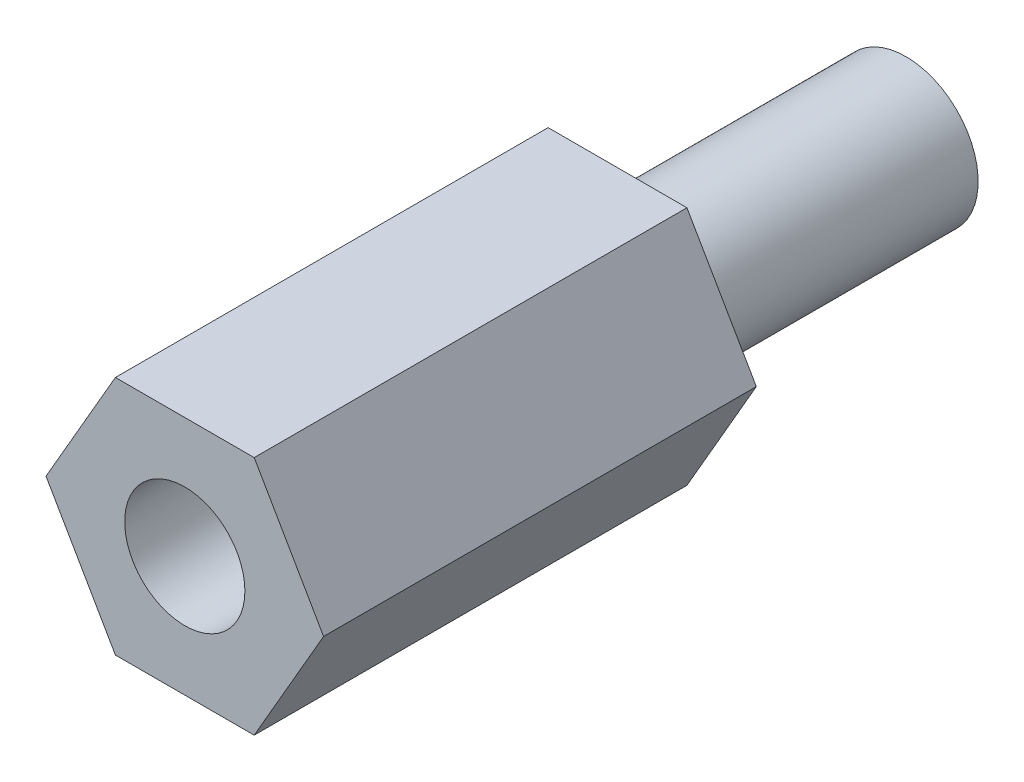
ISO-10303-21;
HEADER;
FILE_DESCRIPTION(('STEP AP214'),'2;1');
FILE_NAME('part.step','',(''),(''),'','','');
FILE_SCHEMA(('AUTOMOTIVE_DESIGN { 1 0 10303 214 1 1 1 1 }'));
ENDSEC;
DATA;
#1=APPLICATION_CONTEXT('core data for automotive mechanical design processes');
#2=APPLICATION_PROTOCOL_DEFINITION('international standard','automotive_design',2000,#1);
#3=PRODUCT_CONTEXT('',#1,'mechanical');
#4=PRODUCT('Part','Part','',(#3));
#5=PRODUCT_RELATED_PRODUCT_CATEGORY('part','',(#4));
#6=PRODUCT_DEFINITION_FORMATION('','',#4);
#7=PRODUCT_DEFINITION_CONTEXT('part definition',#1,'design');
#8=PRODUCT_DEFINITION('design','',#6,#7);
#9=PRODUCT_DEFINITION_SHAPE('','',#8);
#10=(LENGTH_UNIT() NAMED_UNIT(*) SI_UNIT(.MILLI.,.METRE.));
#11=(NAMED_UNIT(*) PLANE_ANGLE_UNIT() SI_UNIT($,.RADIAN.));
#12=(NAMED_UNIT(*) SI_UNIT($,.STERADIAN.) SOLID_ANGLE_UNIT());
#13=UNCERTAINTY_MEASURE_WITH_UNIT(LENGTH_MEASURE(1.E-05),#10,'distance_accuracy_value','');
#14=(GEOMETRIC_REPRESENTATION_CONTEXT(3) GLOBAL_UNCERTAINTY_ASSIGNED_CONTEXT((#13)) GLOBAL_UNIT_ASSIGNED_CONTEXT((#10,
#11,#12)) REPRESENTATION_CONTEXT('',''));
#15=CARTESIAN_POINT('',(0.,0.,0.));
#16=DIRECTION('',(0.,0.,1.));
#17=DIRECTION('',(1.,0.,0.));
#18=AXIS2_PLACEMENT_3D('',#15,#16,#17);
#19=CARTESIAN_POINT('',(1.44337567297406,2.5,9.));
#20=DIRECTION('',(0.,-1.,0.));
#21=DIRECTION('',(1.,0.,0.));
#22=AXIS2_PLACEMENT_3D('',#19,#20,#21);
#23=PLANE('',#22);
#24=DIRECTION('',(-1.,0.,0.));
#25=VECTOR('',#24,1.);
#26=CARTESIAN_POINT('',(1.44337567297406,2.5,0.));
#27=LINE('',#26,#25);
#28=CARTESIAN_POINT('',(1.44337567297406,2.5,0.));
#29=VERTEX_POINT('',#28);
#30=CARTESIAN_POINT('',(-1.44337567297407,2.5,0.));
#31=VERTEX_POINT('',#30);
#32=EDGE_CURVE('E125',#29,#31,#27,.T.);
#33=ORIENTED_EDGE('',*,*,#32,.T.);
#34=DIRECTION('',(0.,0.,-1.));
#35=VECTOR('',#34,1.);
#36=CARTESIAN_POINT('',(-1.44337567297407,2.5,9.));
#37=LINE('',#36,#35);
#38=CARTESIAN_POINT('',(-1.44337567297407,2.5,9.));
#39=VERTEX_POINT('',#38);
#40=EDGE_CURVE('E40',#39,#31,#37,.T.);
#41=ORIENTED_EDGE('',*,*,#40,.F.);
#42=DIRECTION('',(-1.,0.,0.));
#43=VECTOR('',#42,1.);
#44=CARTESIAN_POINT('',(1.44337567297406,2.5,9.));
#45=LINE('',#44,#43);
#46=CARTESIAN_POINT('',(1.44337567297406,2.5,9.));
#47=VERTEX_POINT('',#46);
#48=EDGE_CURVE('E136',#47,#39,#45,.T.);
#49=ORIENTED_EDGE('',*,*,#48,.F.);
#50=DIRECTION('',(0.,0.,-1.));
#51=VECTOR('',#50,1.);
#52=CARTESIAN_POINT('',(1.44337567297406,2.5,9.));
#53=LINE('',#52,#51);
#54=EDGE_CURVE('E121',#47,#29,#53,.T.);
#55=ORIENTED_EDGE('',*,*,#54,.T.);
#56=EDGE_LOOP('',(#33,#41,#49,#55));
#57=FACE_BOUND('',#56,.T.);
#58=ADVANCED_FACE('F37',(#57),#23,.F.);
#59=CARTESIAN_POINT('',(-1.44337567297407,2.5,9.));
#60=DIRECTION('',(0.866025403784439,-0.5,0.));
#61=DIRECTION('',(0.5,0.866025403784439,0.));
#62=AXIS2_PLACEMENT_3D('',#59,#60,#61);
#63=PLANE('',#62);
#64=DIRECTION('',(-0.5,-0.866025403784439,0.));
#65=VECTOR('',#64,1.);
#66=CARTESIAN_POINT('',(-1.44337567297407,2.5,0.));
#67=LINE('',#66,#65);
#68=CARTESIAN_POINT('',(-2.88675134594813,0.,0.));
#69=VERTEX_POINT('',#68);
#70=EDGE_CURVE('E128',#31,#69,#67,.T.);
#71=ORIENTED_EDGE('',*,*,#70,.T.);
#72=DIRECTION('',(0.,0.,-1.));
#73=VECTOR('',#72,1.);
#74=CARTESIAN_POINT('',(-2.88675134594813,0.,9.));
#75=LINE('',#74,#73);
#76=CARTESIAN_POINT('',(-2.88675134594813,0.,9.));
#77=VERTEX_POINT('',#76);
#78=EDGE_CURVE('E139',#77,#69,#75,.T.);
#79=ORIENTED_EDGE('',*,*,#78,.F.);
#80=DIRECTION('',(-0.5,-0.866025403784439,0.));
#81=VECTOR('',#80,1.);
#82=CARTESIAN_POINT('',(-1.44337567297407,2.5,9.));
#83=LINE('',#82,#81);
#84=EDGE_CURVE('E93',#39,#77,#83,.T.);
#85=ORIENTED_EDGE('',*,*,#84,.F.);
#86=ORIENTED_EDGE('',*,*,#40,.T.);
#87=EDGE_LOOP('',(#71,#79,#85,#86));
#88=FACE_BOUND('',#87,.T.);
#89=ADVANCED_FACE('F144',(#88),#63,.F.);
#90=CARTESIAN_POINT('',(-2.88675134594813,0.,9.));
#91=DIRECTION('',(0.866025403784438,0.5,0.));
#92=DIRECTION('',(-0.500000000000001,0.866025403784438,0.));
#93=AXIS2_PLACEMENT_3D('',#90,#91,#92);
#94=PLANE('',#93);
#95=DIRECTION('',(0.5,-0.866025403784438,0.));
#96=VECTOR('',#95,1.);
#97=CARTESIAN_POINT('',(-2.88675134594813,0.,0.));
#98=LINE('',#97,#96);
#99=CARTESIAN_POINT('',(-1.44337567297406,-2.5,0.));
#100=VERTEX_POINT('',#99);
#101=EDGE_CURVE('E131',#69,#100,#98,.T.);
#102=ORIENTED_EDGE('',*,*,#101,.T.);
#103=DIRECTION('',(0.,0.,-1.));
#104=VECTOR('',#103,1.);
#105=CARTESIAN_POINT('',(-1.44337567297406,-2.5,9.));
#106=LINE('',#105,#104);
#107=CARTESIAN_POINT('',(-1.44337567297406,-2.5,9.));
#108=VERTEX_POINT('',#107);
#109=EDGE_CURVE('E116',#108,#100,#106,.T.);
#110=ORIENTED_EDGE('',*,*,#109,.F.);
#111=DIRECTION('',(0.5,-0.866025403784438,0.));
#112=VECTOR('',#111,1.);
#113=CARTESIAN_POINT('',(-2.88675134594813,0.,9.));
#114=LINE('',#113,#112);
#115=EDGE_CURVE('E107',#77,#108,#114,.T.);
#116=ORIENTED_EDGE('',*,*,#115,.F.);
#117=ORIENTED_EDGE('',*,*,#78,.T.);
#118=EDGE_LOOP('',(#102,#110,#116,#117));
#119=FACE_BOUND('',#118,.T.);
#120=ADVANCED_FACE('F150',(#119),#94,.F.);
#121=CARTESIAN_POINT('',(-1.44337567297406,-2.5,9.));
#122=DIRECTION('',(0.,1.,0.));
#123=DIRECTION('',(-1.,0.,0.));
#124=AXIS2_PLACEMENT_3D('',#121,#122,#123);
#125=PLANE('',#124);
#126=DIRECTION('',(1.,0.,0.));
#127=VECTOR('',#126,1.);
#128=CARTESIAN_POINT('',(-1.44337567297406,-2.5,0.));
#129=LINE('',#128,#127);
#130=CARTESIAN_POINT('',(1.44337567297407,-2.5,0.));
#131=VERTEX_POINT('',#130);
#132=EDGE_CURVE('E115',#100,#131,#129,.T.);
#133=ORIENTED_EDGE('',*,*,#132,.T.);
#134=DIRECTION('',(0.,0.,-1.));
#135=VECTOR('',#134,1.);
#136=CARTESIAN_POINT('',(1.44337567297407,-2.5,9.));
#137=LINE('',#136,#135);
#138=CARTESIAN_POINT('',(1.44337567297407,-2.5,9.));
#139=VERTEX_POINT('',#138);
#140=EDGE_CURVE('E112',#139,#131,#137,.T.);
#141=ORIENTED_EDGE('',*,*,#140,.F.);
#142=DIRECTION('',(1.,0.,0.));
#143=VECTOR('',#142,1.);
#144=CARTESIAN_POINT('',(-1.44337567297406,-2.5,9.));
#145=LINE('',#144,#143);
#146=EDGE_CURVE('E101',#108,#139,#145,.T.);
#147=ORIENTED_EDGE('',*,*,#146,.F.);
#148=ORIENTED_EDGE('',*,*,#109,.T.);
#149=EDGE_LOOP('',(#133,#141,#147,#148));
#150=FACE_BOUND('',#149,.T.);
#151=ADVANCED_FACE('F113',(#150),#125,.F.);
#152=CARTESIAN_POINT('',(1.44337567297407,-2.5,9.));
#153=DIRECTION('',(-0.866025403784439,0.5,0.));
#154=DIRECTION('',(-0.5,-0.866025403784439,0.));
#155=AXIS2_PLACEMENT_3D('',#152,#153,#154);
#156=PLANE('',#155);
#157=DIRECTION('',(0.5,0.866025403784439,0.));
#158=VECTOR('',#157,1.);
#159=CARTESIAN_POINT('',(1.44337567297407,-2.5,0.));
#160=LINE('',#159,#158);
#161=CARTESIAN_POINT('',(2.88675134594813,0.,0.));
#162=VERTEX_POINT('',#161);
#163=EDGE_CURVE('E78',#131,#162,#160,.T.);
#164=ORIENTED_EDGE('',*,*,#163,.T.);
#165=DIRECTION('',(0.,0.,-1.));
#166=VECTOR('',#165,1.);
#167=CARTESIAN_POINT('',(2.88675134594813,0.,9.));
#168=LINE('',#167,#166);
#169=CARTESIAN_POINT('',(2.88675134594813,0.,9.));
#170=VERTEX_POINT('',#169);
#171=EDGE_CURVE('E117',#170,#162,#168,.T.);
#172=ORIENTED_EDGE('',*,*,#171,.F.);
#173=DIRECTION('',(0.5,0.866025403784439,0.));
#174=VECTOR('',#173,1.);
#175=CARTESIAN_POINT('',(1.44337567297407,-2.5,9.));
#176=LINE('',#175,#174);
#177=EDGE_CURVE('E105',#139,#170,#176,.T.);
#178=ORIENTED_EDGE('',*,*,#177,.F.);
#179=ORIENTED_EDGE('',*,*,#140,.T.);
#180=EDGE_LOOP('',(#164,#172,#178,#179));
#181=FACE_BOUND('',#180,.T.);
#182=ADVANCED_FACE('F119',(#181),#156,.F.);
#183=CARTESIAN_POINT('',(2.88675134594813,0.,9.));
#184=DIRECTION('',(-0.866025403784439,-0.5,0.));
#185=DIRECTION('',(0.5,-0.866025403784439,0.));
#186=AXIS2_PLACEMENT_3D('',#183,#184,#185);
#187=PLANE('',#186);
#188=DIRECTION('',(-0.5,0.866025403784439,0.));
#189=VECTOR('',#188,1.);
#190=CARTESIAN_POINT('',(2.88675134594813,0.,0.));
#191=LINE('',#190,#189);
#192=EDGE_CURVE('E84',#162,#29,#191,.T.);
#193=ORIENTED_EDGE('',*,*,#192,.T.);
#194=ORIENTED_EDGE('',*,*,#54,.F.);
#195=DIRECTION('',(-0.5,0.866025403784439,0.));
#196=VECTOR('',#195,1.);
#197=CARTESIAN_POINT('',(2.88675134594813,0.,9.));
#198=LINE('',#197,#196);
#199=EDGE_CURVE('E54',#170,#47,#198,.T.);
#200=ORIENTED_EDGE('',*,*,#199,.F.);
#201=ORIENTED_EDGE('',*,*,#171,.T.);
#202=EDGE_LOOP('',(#193,#194,#200,#201));
#203=FACE_BOUND('',#202,.T.);
#204=ADVANCED_FACE('F166',(#203),#187,.F.);
#205=CARTESIAN_POINT('',(0.,0.,9.));
#206=DIRECTION('',(0.,0.,1.));
#207=DIRECTION('',(1.,0.,0.));
#208=AXIS2_PLACEMENT_3D('',#205,#206,#207);
#209=PLANE('',#208);
#210=CARTESIAN_POINT('',(0.,0.,9.));
#211=DIRECTION('',(0.,0.,1.));
#212=DIRECTION('',(1.,0.,0.));
#213=AXIS2_PLACEMENT_3D('',#210,#211,#212);
#214=CIRCLE('',#213,1.24999999999999);
#215=CARTESIAN_POINT('',(1.24999999999999,0.,9.));
#216=VERTEX_POINT('',#215);
#217=EDGE_CURVE('E159',#216,#216,#214,.T.);
#218=ORIENTED_EDGE('',*,*,#217,.F.);
#219=EDGE_LOOP('',(#218));
#220=FACE_BOUND('',#219,.T.);
#221=ORIENTED_EDGE('',*,*,#48,.T.);
#222=ORIENTED_EDGE('',*,*,#84,.T.);
#223=ORIENTED_EDGE('',*,*,#115,.T.);
#224=ORIENTED_EDGE('',*,*,#146,.T.);
#225=ORIENTED_EDGE('',*,*,#177,.T.);
#226=ORIENTED_EDGE('',*,*,#199,.T.);
#227=EDGE_LOOP('',(#221,#222,#223,#224,#225,#226));
#228=FACE_BOUND('',#227,.T.);
#229=ADVANCED_FACE('F103',(#220,#228),#209,.T.);
#230=CARTESIAN_POINT('',(0.,0.,0.));
#231=DIRECTION('',(0.,0.,1.));
#232=DIRECTION('',(1.,0.,0.));
#233=AXIS2_PLACEMENT_3D('',#230,#231,#232);
#234=PLANE('',#233);
#235=CARTESIAN_POINT('',(0.,0.,0.));
#236=DIRECTION('',(0.,0.,-1.));
#237=DIRECTION('',(-1.,0.,0.));
#238=AXIS2_PLACEMENT_3D('',#235,#236,#237);
#239=CIRCLE('',#238,1.5);
#240=CARTESIAN_POINT('',(-1.5,0.,0.));
#241=VERTEX_POINT('',#240);
#242=EDGE_CURVE('E11',#241,#241,#239,.T.);
#243=ORIENTED_EDGE('',*,*,#242,.F.);
#244=EDGE_LOOP('',(#243));
#245=FACE_BOUND('',#244,.T.);
#246=ORIENTED_EDGE('',*,*,#32,.F.);
#247=ORIENTED_EDGE('',*,*,#192,.F.);
#248=ORIENTED_EDGE('',*,*,#163,.F.);
#249=ORIENTED_EDGE('',*,*,#132,.F.);
#250=ORIENTED_EDGE('',*,*,#101,.F.);
#251=ORIENTED_EDGE('',*,*,#70,.F.);
#252=EDGE_LOOP('',(#246,#247,#248,#249,#250,#251));
#253=FACE_BOUND('',#252,.T.);
#254=ADVANCED_FACE('F149',(#245,#253),#234,.F.);
#255=CARTESIAN_POINT('',(0.,0.,-6.));
#256=DIRECTION('',(0.,0.,1.));
#257=DIRECTION('',(1.,0.,0.));
#258=AXIS2_PLACEMENT_3D('',#255,#256,#257);
#259=CYLINDRICAL_SURFACE('',#258,1.5);
#260=CARTESIAN_POINT('',(0.,0.,-6.));
#261=DIRECTION('',(0.,0.,-1.));
#262=DIRECTION('',(-1.,0.,0.));
#263=AXIS2_PLACEMENT_3D('',#260,#261,#262);
#264=CIRCLE('',#263,1.5);
#265=CARTESIAN_POINT('',(-1.5,0.,-6.));
#266=VERTEX_POINT('',#265);
#267=EDGE_CURVE('E129',#266,#266,#264,.T.);
#268=ORIENTED_EDGE('',*,*,#267,.F.);
#269=EDGE_LOOP('',(#268));
#270=FACE_BOUND('',#269,.T.);
#271=ORIENTED_EDGE('',*,*,#242,.T.);
#272=EDGE_LOOP('',(#271));
#273=FACE_BOUND('',#272,.T.);
#274=ADVANCED_FACE('F172',(#270,#273),#259,.T.);
#275=CARTESIAN_POINT('',(0.,0.,-6.));
#276=DIRECTION('',(0.,0.,-1.));
#277=DIRECTION('',(-1.,0.,0.));
#278=AXIS2_PLACEMENT_3D('',#275,#276,#277);
#279=PLANE('',#278);
#280=ORIENTED_EDGE('',*,*,#267,.T.);
#281=EDGE_LOOP('',(#280));
#282=FACE_BOUND('',#281,.T.);
#283=ADVANCED_FACE('F213',(#282),#279,.T.);
#284=CARTESIAN_POINT('',(0.,0.,1.5));
#285=DIRECTION('',(0.,0.,1.));
#286=DIRECTION('',(1.,0.,0.));
#287=AXIS2_PLACEMENT_3D('',#284,#285,#286);
#288=CONICAL_SURFACE('',#287,1.25,1.02974425867665);
#289=CARTESIAN_POINT('',(0.,0.,0.74892422621555));
#290=VERTEX_POINT('',#289);
#291=VERTEX_LOOP('',#290);
#292=FACE_BOUND('',#291,.T.);
#293=CARTESIAN_POINT('',(0.,0.,1.5));
#294=DIRECTION('',(0.,0.,1.));
#295=DIRECTION('',(1.,0.,0.));
#296=AXIS2_PLACEMENT_3D('',#293,#294,#295);
#297=CIRCLE('',#296,1.25);
#298=CARTESIAN_POINT('',(1.25,0.,1.5));
#299=VERTEX_POINT('',#298);
#300=EDGE_CURVE('E156',#299,#299,#297,.T.);
#301=ORIENTED_EDGE('',*,*,#300,.T.);
#302=EDGE_LOOP('',(#301));
#303=FACE_BOUND('',#302,.T.);
#304=ADVANCED_FACE('F221',(#292,#303),#288,.F.);
#305=CARTESIAN_POINT('',(0.,0.,9.));
#306=DIRECTION('',(0.,0.,1.));
#307=DIRECTION('',(1.,0.,0.));
#308=AXIS2_PLACEMENT_3D('',#305,#306,#307);
#309=CYLINDRICAL_SURFACE('',#308,1.24999999999999);
#310=ORIENTED_EDGE('',*,*,#300,.F.);
#311=EDGE_LOOP('',(#310));
#312=FACE_BOUND('',#311,.T.);
#313=ORIENTED_EDGE('',*,*,#217,.T.);
#314=EDGE_LOOP('',(#313));
#315=FACE_BOUND('',#314,.T.);
#316=ADVANCED_FACE('F163',(#312,#315),#309,.F.);
#317=CLOSED_SHELL('',(#58,#89,#120,#151,#182,#204,#229,#254,#274,#283,#304,#316));
#318=MANIFOLD_SOLID_BREP('B2',#317);
#319=ADVANCED_BREP_SHAPE_REPRESENTATION('',(#18,#318),#14);
#320=SHAPE_DEFINITION_REPRESENTATION(#9,#319);
ENDSEC;
END-ISO-10303-21;
